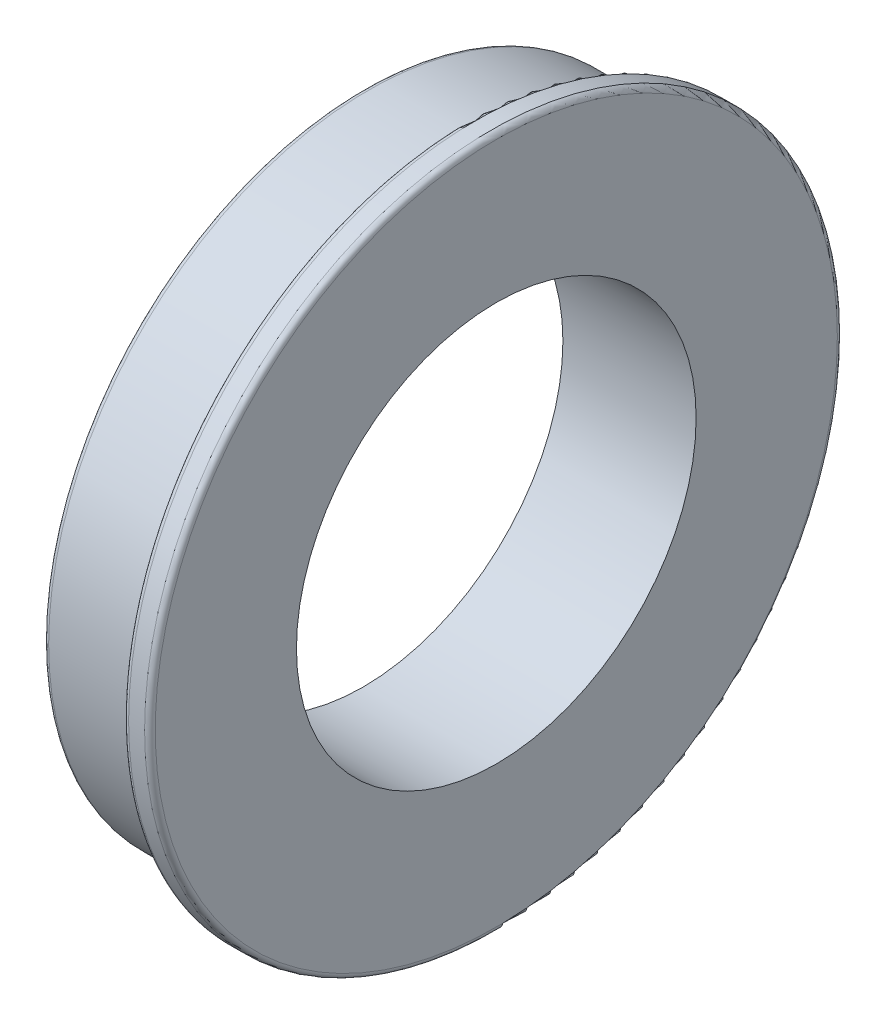
ISO-10303-21;
HEADER;
FILE_DESCRIPTION(('STEP AP214'),'2;1');
FILE_NAME('part.step','',(''),(''),'','','');
FILE_SCHEMA(('AUTOMOTIVE_DESIGN { 1 0 10303 214 1 1 1 1 }'));
ENDSEC;
DATA;
#1=APPLICATION_CONTEXT('core data for automotive mechanical design processes');
#2=APPLICATION_PROTOCOL_DEFINITION('international standard','automotive_design',2000,#1);
#3=PRODUCT_CONTEXT('',#1,'mechanical');
#4=PRODUCT('Part','Part','',(#3));
#5=PRODUCT_RELATED_PRODUCT_CATEGORY('part','',(#4));
#6=PRODUCT_DEFINITION_FORMATION('','',#4);
#7=PRODUCT_DEFINITION_CONTEXT('part definition',#1,'design');
#8=PRODUCT_DEFINITION('design','',#6,#7);
#9=PRODUCT_DEFINITION_SHAPE('','',#8);
#10=(LENGTH_UNIT() NAMED_UNIT(*) SI_UNIT(.MILLI.,.METRE.));
#11=(NAMED_UNIT(*) PLANE_ANGLE_UNIT() SI_UNIT($,.RADIAN.));
#12=(NAMED_UNIT(*) SI_UNIT($,.STERADIAN.) SOLID_ANGLE_UNIT());
#13=UNCERTAINTY_MEASURE_WITH_UNIT(LENGTH_MEASURE(1.E-05),#10,'distance_accuracy_value','');
#14=(GEOMETRIC_REPRESENTATION_CONTEXT(3) GLOBAL_UNCERTAINTY_ASSIGNED_CONTEXT((#13)) GLOBAL_UNIT_ASSIGNED_CONTEXT((#10,
#11,#12)) REPRESENTATION_CONTEXT('',''));
#15=CARTESIAN_POINT('',(0.,0.,0.));
#16=DIRECTION('',(0.,0.,1.));
#17=DIRECTION('',(1.,0.,0.));
#18=AXIS2_PLACEMENT_3D('',#15,#16,#17);
#19=CARTESIAN_POINT('',(4.,0.,0.));
#20=DIRECTION('',(-1.,0.,0.));
#21=DIRECTION('',(0.,0.,1.));
#22=AXIS2_PLACEMENT_3D('',#19,#20,#21);
#23=CYLINDRICAL_SURFACE('',#22,12.);
#24=CARTESIAN_POINT('',(0.2,0.,0.));
#25=DIRECTION('',(1.,0.,0.));
#26=DIRECTION('',(0.,0.,-1.));
#27=AXIS2_PLACEMENT_3D('',#24,#25,#26);
#28=CIRCLE('',#27,12.);
#29=CARTESIAN_POINT('',(0.2,0.,-12.));
#30=VERTEX_POINT('',#29);
#31=EDGE_CURVE('E41',#30,#30,#28,.T.);
#32=ORIENTED_EDGE('',*,*,#31,.T.);
#33=EDGE_LOOP('',(#32));
#34=FACE_BOUND('',#33,.T.);
#35=CARTESIAN_POINT('',(4.,0.,0.));
#36=DIRECTION('',(1.,0.,0.));
#37=DIRECTION('',(0.,0.,-1.));
#38=AXIS2_PLACEMENT_3D('',#35,#36,#37);
#39=CIRCLE('',#38,12.);
#40=CARTESIAN_POINT('',(4.,0.,-12.));
#41=VERTEX_POINT('',#40);
#42=EDGE_CURVE('E60',#41,#41,#39,.T.);
#43=ORIENTED_EDGE('',*,*,#42,.F.);
#44=EDGE_LOOP('',(#43));
#45=FACE_BOUND('',#44,.T.);
#46=ADVANCED_FACE('F34',(#34,#45),#23,.T.);
#47=CARTESIAN_POINT('',(0.,0.,0.));
#48=DIRECTION('',(1.,0.,0.));
#49=DIRECTION('',(0.,0.,-1.));
#50=AXIS2_PLACEMENT_3D('',#47,#48,#49);
#51=PLANE('',#50);
#52=CARTESIAN_POINT('',(0.,0.,0.));
#53=DIRECTION('',(1.,0.,0.));
#54=DIRECTION('',(0.,0.,-1.));
#55=AXIS2_PLACEMENT_3D('',#52,#53,#54);
#56=CIRCLE('',#55,11.8);
#57=CARTESIAN_POINT('',(0.,0.,-11.8));
#58=VERTEX_POINT('',#57);
#59=EDGE_CURVE('E10',#58,#58,#56,.F.);
#60=ORIENTED_EDGE('',*,*,#59,.T.);
#61=EDGE_LOOP('',(#60));
#62=FACE_BOUND('',#61,.T.);
#63=CARTESIAN_POINT('',(0.,0.,0.));
#64=DIRECTION('',(-1.,0.,0.));
#65=DIRECTION('',(0.,0.,1.));
#66=AXIS2_PLACEMENT_3D('',#63,#64,#65);
#67=CIRCLE('',#66,7.5);
#68=CARTESIAN_POINT('',(0.,0.,7.5));
#69=VERTEX_POINT('',#68);
#70=EDGE_CURVE('E64',#69,#69,#67,.T.);
#71=ORIENTED_EDGE('',*,*,#70,.F.);
#72=EDGE_LOOP('',(#71));
#73=FACE_BOUND('',#72,.T.);
#74=ADVANCED_FACE('F80',(#62,#73),#51,.F.);
#75=CARTESIAN_POINT('',(5.,0.,0.));
#76=DIRECTION('',(-1.,0.,0.));
#77=DIRECTION('',(0.,0.,1.));
#78=AXIS2_PLACEMENT_3D('',#75,#76,#77);
#79=CYLINDRICAL_SURFACE('',#78,13.);
#80=CARTESIAN_POINT('',(4.8,0.,0.));
#81=DIRECTION('',(1.,0.,0.));
#82=DIRECTION('',(0.,0.,-1.));
#83=AXIS2_PLACEMENT_3D('',#80,#81,#82);
#84=CIRCLE('',#83,13.);
#85=CARTESIAN_POINT('',(4.8,0.,-13.));
#86=VERTEX_POINT('',#85);
#87=EDGE_CURVE('E49',#86,#86,#84,.F.);
#88=ORIENTED_EDGE('',*,*,#87,.T.);
#89=EDGE_LOOP('',(#88));
#90=FACE_BOUND('',#89,.T.);
#91=CARTESIAN_POINT('',(4.2,0.,0.));
#92=DIRECTION('',(1.,0.,0.));
#93=DIRECTION('',(0.,0.,-1.));
#94=AXIS2_PLACEMENT_3D('',#91,#92,#93);
#95=CIRCLE('',#94,13.);
#96=CARTESIAN_POINT('',(4.2,0.,-13.));
#97=VERTEX_POINT('',#96);
#98=EDGE_CURVE('E54',#97,#97,#95,.T.);
#99=ORIENTED_EDGE('',*,*,#98,.T.);
#100=EDGE_LOOP('',(#99));
#101=FACE_BOUND('',#100,.T.);
#102=ADVANCED_FACE('F82',(#90,#101),#79,.T.);
#103=CARTESIAN_POINT('',(5.,0.,0.));
#104=DIRECTION('',(1.,0.,0.));
#105=DIRECTION('',(0.,0.,-1.));
#106=AXIS2_PLACEMENT_3D('',#103,#104,#105);
#107=PLANE('',#106);
#108=CARTESIAN_POINT('',(5.,0.,0.));
#109=DIRECTION('',(1.,0.,0.));
#110=DIRECTION('',(0.,0.,-1.));
#111=AXIS2_PLACEMENT_3D('',#108,#109,#110);
#112=CIRCLE('',#111,12.8);
#113=CARTESIAN_POINT('',(5.,0.,-12.8));
#114=VERTEX_POINT('',#113);
#115=EDGE_CURVE('E57',#114,#114,#112,.T.);
#116=ORIENTED_EDGE('',*,*,#115,.T.);
#117=EDGE_LOOP('',(#116));
#118=FACE_BOUND('',#117,.T.);
#119=CARTESIAN_POINT('',(5.,0.,0.));
#120=DIRECTION('',(-1.,0.,0.));
#121=DIRECTION('',(0.,0.,1.));
#122=AXIS2_PLACEMENT_3D('',#119,#120,#121);
#123=CIRCLE('',#122,7.5);
#124=CARTESIAN_POINT('',(5.,0.,7.5));
#125=VERTEX_POINT('',#124);
#126=EDGE_CURVE('E63',#125,#125,#123,.T.);
#127=ORIENTED_EDGE('',*,*,#126,.T.);
#128=EDGE_LOOP('',(#127));
#129=FACE_BOUND('',#128,.T.);
#130=ADVANCED_FACE('F70',(#118,#129),#107,.T.);
#131=CARTESIAN_POINT('',(4.,0.,0.));
#132=DIRECTION('',(1.,0.,0.));
#133=DIRECTION('',(0.,0.,-1.));
#134=AXIS2_PLACEMENT_3D('',#131,#132,#133);
#135=PLANE('',#134);
#136=CARTESIAN_POINT('',(4.,0.,0.));
#137=DIRECTION('',(1.,0.,0.));
#138=DIRECTION('',(0.,0.,-1.));
#139=AXIS2_PLACEMENT_3D('',#136,#137,#138);
#140=CIRCLE('',#139,12.8);
#141=CARTESIAN_POINT('',(4.,0.,-12.8));
#142=VERTEX_POINT('',#141);
#143=EDGE_CURVE('E45',#142,#142,#140,.F.);
#144=ORIENTED_EDGE('',*,*,#143,.T.);
#145=EDGE_LOOP('',(#144));
#146=FACE_BOUND('',#145,.T.);
#147=ORIENTED_EDGE('',*,*,#42,.T.);
#148=EDGE_LOOP('',(#147));
#149=FACE_BOUND('',#148,.T.);
#150=ADVANCED_FACE('F76',(#146,#149),#135,.F.);
#151=CARTESIAN_POINT('',(5.,0.,0.));
#152=DIRECTION('',(-1.,0.,0.));
#153=DIRECTION('',(0.,0.,1.));
#154=AXIS2_PLACEMENT_3D('',#151,#152,#153);
#155=CYLINDRICAL_SURFACE('',#154,7.5);
#156=ORIENTED_EDGE('',*,*,#126,.F.);
#157=EDGE_LOOP('',(#156));
#158=FACE_BOUND('',#157,.T.);
#159=ORIENTED_EDGE('',*,*,#70,.T.);
#160=EDGE_LOOP('',(#159));
#161=FACE_BOUND('',#160,.T.);
#162=ADVANCED_FACE('F72',(#158,#161),#155,.F.);
#163=CARTESIAN_POINT('',(4.8,0.,0.));
#164=DIRECTION('',(1.,0.,0.));
#165=DIRECTION('',(0.,0.,-1.));
#166=AXIS2_PLACEMENT_3D('',#163,#164,#165);
#167=TOROIDAL_SURFACE('',#166,12.8,0.2);
#168=ORIENTED_EDGE('',*,*,#87,.F.);
#169=EDGE_LOOP('',(#168));
#170=FACE_BOUND('',#169,.T.);
#171=ORIENTED_EDGE('',*,*,#115,.F.);
#172=EDGE_LOOP('',(#171));
#173=FACE_BOUND('',#172,.T.);
#174=ADVANCED_FACE('F75',(#170,#173),#167,.T.);
#175=CARTESIAN_POINT('',(4.2,0.,0.));
#176=DIRECTION('',(1.,0.,0.));
#177=DIRECTION('',(0.,0.,-1.));
#178=AXIS2_PLACEMENT_3D('',#175,#176,#177);
#179=TOROIDAL_SURFACE('',#178,12.8,0.2);
#180=ORIENTED_EDGE('',*,*,#143,.F.);
#181=EDGE_LOOP('',(#180));
#182=FACE_BOUND('',#181,.T.);
#183=ORIENTED_EDGE('',*,*,#98,.F.);
#184=EDGE_LOOP('',(#183));
#185=FACE_BOUND('',#184,.T.);
#186=ADVANCED_FACE('F94',(#182,#185),#179,.T.);
#187=CARTESIAN_POINT('',(0.2,0.,0.));
#188=DIRECTION('',(1.,0.,0.));
#189=DIRECTION('',(0.,0.,-1.));
#190=AXIS2_PLACEMENT_3D('',#187,#188,#189);
#191=TOROIDAL_SURFACE('',#190,11.8,0.2);
#192=ORIENTED_EDGE('',*,*,#59,.F.);
#193=EDGE_LOOP('',(#192));
#194=FACE_BOUND('',#193,.T.);
#195=ORIENTED_EDGE('',*,*,#31,.F.);
#196=EDGE_LOOP('',(#195));
#197=FACE_BOUND('',#196,.T.);
#198=ADVANCED_FACE('F36',(#194,#197),#191,.T.);
#199=CLOSED_SHELL('',(#46,#74,#102,#130,#150,#162,#174,#186,#198));
#200=MANIFOLD_SOLID_BREP('B2',#199);
#201=ADVANCED_BREP_SHAPE_REPRESENTATION('',(#18,#200),#14);
#202=SHAPE_DEFINITION_REPRESENTATION(#9,#201);
ENDSEC;
END-ISO-10303-21;
